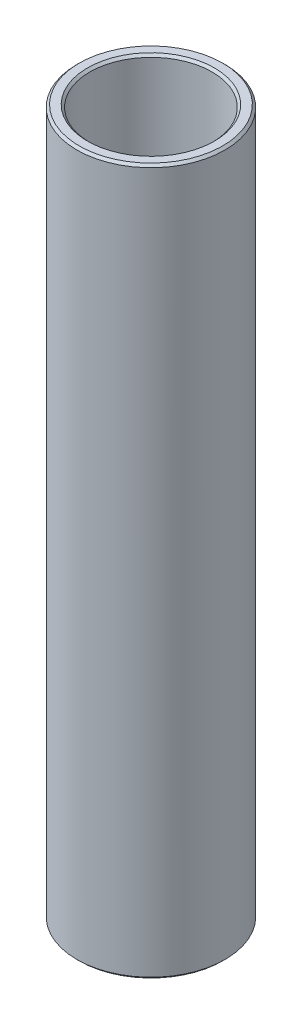
ISO-10303-21;
HEADER;
FILE_DESCRIPTION(('STEP AP214'),'2;1');
FILE_NAME('part.step','',(''),(''),'','','');
FILE_SCHEMA(('AUTOMOTIVE_DESIGN { 1 0 10303 214 1 1 1 1 }'));
ENDSEC;
DATA;
#1=APPLICATION_CONTEXT('core data for automotive mechanical design processes');
#2=APPLICATION_PROTOCOL_DEFINITION('international standard','automotive_design',2000,#1);
#3=PRODUCT_CONTEXT('',#1,'mechanical');
#4=PRODUCT('Part','Part','',(#3));
#5=PRODUCT_RELATED_PRODUCT_CATEGORY('part','',(#4));
#6=PRODUCT_DEFINITION_FORMATION('','',#4);
#7=PRODUCT_DEFINITION_CONTEXT('part definition',#1,'design');
#8=PRODUCT_DEFINITION('design','',#6,#7);
#9=PRODUCT_DEFINITION_SHAPE('','',#8);
#10=(LENGTH_UNIT() NAMED_UNIT(*) SI_UNIT(.MILLI.,.METRE.));
#11=(NAMED_UNIT(*) PLANE_ANGLE_UNIT() SI_UNIT($,.RADIAN.));
#12=(NAMED_UNIT(*) SI_UNIT($,.STERADIAN.) SOLID_ANGLE_UNIT());
#13=UNCERTAINTY_MEASURE_WITH_UNIT(LENGTH_MEASURE(1.E-05),#10,'distance_accuracy_value','');
#14=(GEOMETRIC_REPRESENTATION_CONTEXT(3) GLOBAL_UNCERTAINTY_ASSIGNED_CONTEXT((#13)) GLOBAL_UNIT_ASSIGNED_CONTEXT((#10,
#11,#12)) REPRESENTATION_CONTEXT('',''));
#15=CARTESIAN_POINT('',(0.,0.,0.));
#16=DIRECTION('',(0.,0.,1.));
#17=DIRECTION('',(1.,0.,0.));
#18=AXIS2_PLACEMENT_3D('',#15,#16,#17);
#19=CARTESIAN_POINT('',(4.,19.05,0.));
#20=DIRECTION('',(0.,-1.,0.));
#21=DIRECTION('',(0.,0.,-1.));
#22=AXIS2_PLACEMENT_3D('',#19,#20,#21);
#23=PLANE('',#22);
#24=CARTESIAN_POINT('',(0.,19.05,0.));
#25=DIRECTION('',(0.,-1.,0.));
#26=DIRECTION('',(0.,0.,-1.));
#27=AXIS2_PLACEMENT_3D('',#24,#25,#26);
#28=CIRCLE('',#27,3.87300000000002);
#29=CARTESIAN_POINT('',(0.,19.05,-3.87300000000002));
#30=VERTEX_POINT('',#29);
#31=EDGE_CURVE('E10',#30,#30,#28,.F.);
#32=ORIENTED_EDGE('',*,*,#31,.T.);
#33=EDGE_LOOP('',(#32));
#34=FACE_BOUND('',#33,.T.);
#35=CARTESIAN_POINT('',(0.,19.05,0.));
#36=DIRECTION('',(0.,-1.,0.));
#37=DIRECTION('',(0.,0.,-1.));
#38=AXIS2_PLACEMENT_3D('',#35,#36,#37);
#39=CIRCLE('',#38,3.42700000000001);
#40=CARTESIAN_POINT('',(0.,19.05,-3.42700000000001));
#41=VERTEX_POINT('',#40);
#42=EDGE_CURVE('E37',#41,#41,#39,.T.);
#43=ORIENTED_EDGE('',*,*,#42,.T.);
#44=EDGE_LOOP('',(#43));
#45=FACE_BOUND('',#44,.T.);
#46=ADVANCED_FACE('F30',(#34,#45),#23,.F.);
#47=CARTESIAN_POINT('',(0.,7.40676436133045,0.));
#48=DIRECTION('',(0.,1.,0.));
#49=DIRECTION('',(0.,0.,1.));
#50=AXIS2_PLACEMENT_3D('',#47,#48,#49);
#51=CYLINDRICAL_SURFACE('',#50,3.3);
#52=CARTESIAN_POINT('',(0.,-18.923,0.));
#53=DIRECTION('',(0.,1.,0.));
#54=DIRECTION('',(0.,0.,1.));
#55=AXIS2_PLACEMENT_3D('',#52,#53,#54);
#56=CIRCLE('',#55,3.3);
#57=CARTESIAN_POINT('',(0.,-18.923,3.3));
#58=VERTEX_POINT('',#57);
#59=EDGE_CURVE('E50',#58,#58,#56,.F.);
#60=ORIENTED_EDGE('',*,*,#59,.T.);
#61=EDGE_LOOP('',(#60));
#62=FACE_BOUND('',#61,.T.);
#63=CARTESIAN_POINT('',(0.,18.923,0.));
#64=DIRECTION('',(0.,-1.,0.));
#65=DIRECTION('',(0.,0.,-1.));
#66=AXIS2_PLACEMENT_3D('',#63,#64,#65);
#67=CIRCLE('',#66,3.3);
#68=CARTESIAN_POINT('',(0.,18.923,-3.3));
#69=VERTEX_POINT('',#68);
#70=EDGE_CURVE('E53',#69,#69,#67,.F.);
#71=ORIENTED_EDGE('',*,*,#70,.T.);
#72=EDGE_LOOP('',(#71));
#73=FACE_BOUND('',#72,.T.);
#74=ADVANCED_FACE('F86',(#62,#73),#51,.F.);
#75=CARTESIAN_POINT('',(3.3,-19.05,0.));
#76=DIRECTION('',(0.,1.,0.));
#77=DIRECTION('',(0.,0.,1.));
#78=AXIS2_PLACEMENT_3D('',#75,#76,#77);
#79=PLANE('',#78);
#80=CARTESIAN_POINT('',(0.,-19.05,0.));
#81=DIRECTION('',(0.,1.,0.));
#82=DIRECTION('',(0.,0.,1.));
#83=AXIS2_PLACEMENT_3D('',#80,#81,#82);
#84=CIRCLE('',#83,3.427);
#85=CARTESIAN_POINT('',(0.,-19.05,3.427));
#86=VERTEX_POINT('',#85);
#87=EDGE_CURVE('E56',#86,#86,#84,.T.);
#88=ORIENTED_EDGE('',*,*,#87,.T.);
#89=EDGE_LOOP('',(#88));
#90=FACE_BOUND('',#89,.T.);
#91=CARTESIAN_POINT('',(0.,-19.05,0.));
#92=DIRECTION('',(0.,1.,0.));
#93=DIRECTION('',(0.,0.,1.));
#94=AXIS2_PLACEMENT_3D('',#91,#92,#93);
#95=CIRCLE('',#94,3.873);
#96=CARTESIAN_POINT('',(0.,-19.05,3.873));
#97=VERTEX_POINT('',#96);
#98=EDGE_CURVE('E59',#97,#97,#95,.F.);
#99=ORIENTED_EDGE('',*,*,#98,.T.);
#100=EDGE_LOOP('',(#99));
#101=FACE_BOUND('',#100,.T.);
#102=ADVANCED_FACE('F63',(#90,#101),#79,.F.);
#103=CARTESIAN_POINT('',(0.,7.40676436133045,0.));
#104=DIRECTION('',(0.,1.,0.));
#105=DIRECTION('',(0.,0.,1.));
#106=AXIS2_PLACEMENT_3D('',#103,#104,#105);
#107=CYLINDRICAL_SURFACE('',#106,4.);
#108=CARTESIAN_POINT('',(0.,-18.923,0.));
#109=DIRECTION('',(0.,1.,0.));
#110=DIRECTION('',(0.,0.,1.));
#111=AXIS2_PLACEMENT_3D('',#108,#109,#110);
#112=CIRCLE('',#111,4.);
#113=CARTESIAN_POINT('',(0.,-18.923,4.));
#114=VERTEX_POINT('',#113);
#115=EDGE_CURVE('E41',#114,#114,#112,.T.);
#116=ORIENTED_EDGE('',*,*,#115,.T.);
#117=EDGE_LOOP('',(#116));
#118=FACE_BOUND('',#117,.T.);
#119=CARTESIAN_POINT('',(0.,18.923,0.));
#120=DIRECTION('',(0.,-1.,0.));
#121=DIRECTION('',(0.,0.,-1.));
#122=AXIS2_PLACEMENT_3D('',#119,#120,#121);
#123=CIRCLE('',#122,4.);
#124=CARTESIAN_POINT('',(0.,18.923,-4.));
#125=VERTEX_POINT('',#124);
#126=EDGE_CURVE('E45',#125,#125,#123,.T.);
#127=ORIENTED_EDGE('',*,*,#126,.T.);
#128=EDGE_LOOP('',(#127));
#129=FACE_BOUND('',#128,.T.);
#130=ADVANCED_FACE('F73',(#118,#129),#107,.T.);
#131=CARTESIAN_POINT('',(0.,-19.05,0.));
#132=DIRECTION('',(0.,-1.,0.));
#133=DIRECTION('',(0.,0.,-1.));
#134=AXIS2_PLACEMENT_3D('',#131,#132,#133);
#135=CONICAL_SURFACE('',#134,3.427,0.785398163397445);
#136=ORIENTED_EDGE('',*,*,#59,.F.);
#137=EDGE_LOOP('',(#136));
#138=FACE_BOUND('',#137,.T.);
#139=ORIENTED_EDGE('',*,*,#87,.F.);
#140=EDGE_LOOP('',(#139));
#141=FACE_BOUND('',#140,.T.);
#142=ADVANCED_FACE('F69',(#138,#141),#135,.F.);
#143=CARTESIAN_POINT('',(0.,-18.923,0.));
#144=DIRECTION('',(0.,1.,0.));
#145=DIRECTION('',(0.,0.,1.));
#146=AXIS2_PLACEMENT_3D('',#143,#144,#145);
#147=CONICAL_SURFACE('',#146,4.,0.785398163397452);
#148=ORIENTED_EDGE('',*,*,#98,.F.);
#149=EDGE_LOOP('',(#148));
#150=FACE_BOUND('',#149,.T.);
#151=ORIENTED_EDGE('',*,*,#115,.F.);
#152=EDGE_LOOP('',(#151));
#153=FACE_BOUND('',#152,.T.);
#154=ADVANCED_FACE('F65',(#150,#153),#147,.T.);
#155=CARTESIAN_POINT('',(0.,19.05,0.));
#156=DIRECTION('',(0.,-1.,0.));
#157=DIRECTION('',(0.,0.,-1.));
#158=AXIS2_PLACEMENT_3D('',#155,#156,#157);
#159=CONICAL_SURFACE('',#158,3.87300000000002,0.785398163397424);
#160=ORIENTED_EDGE('',*,*,#126,.F.);
#161=EDGE_LOOP('',(#160));
#162=FACE_BOUND('',#161,.T.);
#163=ORIENTED_EDGE('',*,*,#31,.F.);
#164=EDGE_LOOP('',(#163));
#165=FACE_BOUND('',#164,.T.);
#166=ADVANCED_FACE('F68',(#162,#165),#159,.T.);
#167=CARTESIAN_POINT('',(0.,18.923,0.));
#168=DIRECTION('',(0.,1.,0.));
#169=DIRECTION('',(0.,0.,1.));
#170=AXIS2_PLACEMENT_3D('',#167,#168,#169);
#171=CONICAL_SURFACE('',#170,3.3,0.785398163397447);
#172=ORIENTED_EDGE('',*,*,#42,.F.);
#173=EDGE_LOOP('',(#172));
#174=FACE_BOUND('',#173,.T.);
#175=ORIENTED_EDGE('',*,*,#70,.F.);
#176=EDGE_LOOP('',(#175));
#177=FACE_BOUND('',#176,.T.);
#178=ADVANCED_FACE('F32',(#174,#177),#171,.F.);
#179=CLOSED_SHELL('',(#46,#74,#102,#130,#142,#154,#166,#178));
#180=MANIFOLD_SOLID_BREP('B2',#179);
#181=ADVANCED_BREP_SHAPE_REPRESENTATION('',(#18,#180),#14);
#182=SHAPE_DEFINITION_REPRESENTATION(#9,#181);
ENDSEC;
END-ISO-10303-21;
